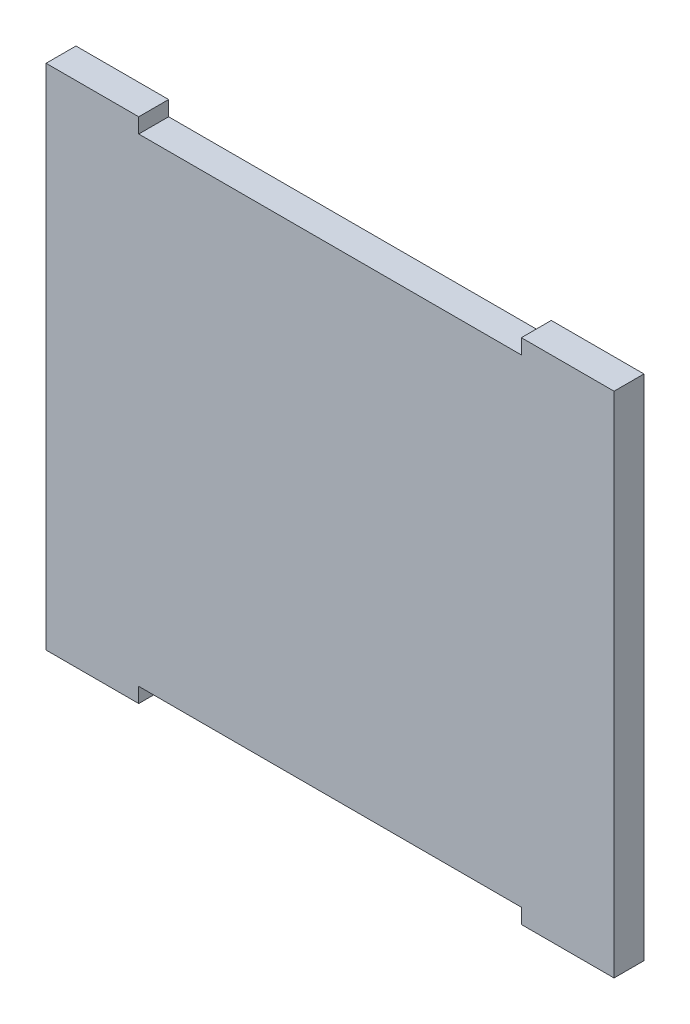
ISO-10303-21;
HEADER;
FILE_DESCRIPTION(('STEP AP214'),'2;1');
FILE_NAME('part.step','',(''),(''),'','','');
FILE_SCHEMA(('AUTOMOTIVE_DESIGN { 1 0 10303 214 1 1 1 1 }'));
ENDSEC;
DATA;
#1=APPLICATION_CONTEXT('core data for automotive mechanical design processes');
#2=APPLICATION_PROTOCOL_DEFINITION('international standard','automotive_design',2000,#1);
#3=PRODUCT_CONTEXT('',#1,'mechanical');
#4=PRODUCT('Part','Part','',(#3));
#5=PRODUCT_RELATED_PRODUCT_CATEGORY('part','',(#4));
#6=PRODUCT_DEFINITION_FORMATION('','',#4);
#7=PRODUCT_DEFINITION_CONTEXT('part definition',#1,'design');
#8=PRODUCT_DEFINITION('design','',#6,#7);
#9=PRODUCT_DEFINITION_SHAPE('','',#8);
#10=(LENGTH_UNIT() NAMED_UNIT(*) SI_UNIT(.MILLI.,.METRE.));
#11=(NAMED_UNIT(*) PLANE_ANGLE_UNIT() SI_UNIT($,.RADIAN.));
#12=(NAMED_UNIT(*) SI_UNIT($,.STERADIAN.) SOLID_ANGLE_UNIT());
#13=UNCERTAINTY_MEASURE_WITH_UNIT(LENGTH_MEASURE(1.E-05),#10,'distance_accuracy_value','');
#14=(GEOMETRIC_REPRESENTATION_CONTEXT(3) GLOBAL_UNCERTAINTY_ASSIGNED_CONTEXT((#13)) GLOBAL_UNIT_ASSIGNED_CONTEXT((#10,
#11,#12)) REPRESENTATION_CONTEXT('',''));
#15=CARTESIAN_POINT('',(0.,0.,0.));
#16=DIRECTION('',(0.,0.,1.));
#17=DIRECTION('',(1.,0.,0.));
#18=AXIS2_PLACEMENT_3D('',#15,#16,#17);
#19=CARTESIAN_POINT('',(0.,373.563048005149,10.));
#20=DIRECTION('',(0.,-1.,0.));
#21=DIRECTION('',(0.,0.,-1.));
#22=AXIS2_PLACEMENT_3D('',#19,#20,#21);
#23=PLANE('',#22);
#24=DIRECTION('',(-1.,0.,0.));
#25=VECTOR('',#24,1.);
#26=CARTESIAN_POINT('',(0.,373.563048005149,0.));
#27=LINE('',#26,#25);
#28=CARTESIAN_POINT('',(1270.86408160644,373.563048005149,0.));
#29=VERTEX_POINT('',#28);
#30=CARTESIAN_POINT('',(1239.86408160644,373.563048005149,0.));
#31=VERTEX_POINT('',#30);
#32=EDGE_CURVE('E152',#29,#31,#27,.T.);
#33=ORIENTED_EDGE('',*,*,#32,.F.);
#34=DIRECTION('',(0.,0.,-1.));
#35=VECTOR('',#34,1.);
#36=CARTESIAN_POINT('',(1270.86408160644,373.563048005149,10.));
#37=LINE('',#36,#35);
#38=CARTESIAN_POINT('',(1270.86408160644,373.563048005149,10.));
#39=VERTEX_POINT('',#38);
#40=EDGE_CURVE('E11',#39,#29,#37,.T.);
#41=ORIENTED_EDGE('',*,*,#40,.F.);
#42=DIRECTION('',(-1.,0.,0.));
#43=VECTOR('',#42,1.);
#44=CARTESIAN_POINT('',(0.,373.563048005149,10.));
#45=LINE('',#44,#43);
#46=CARTESIAN_POINT('',(1239.86408160644,373.563048005149,10.));
#47=VERTEX_POINT('',#46);
#48=EDGE_CURVE('E183',#39,#47,#45,.T.);
#49=ORIENTED_EDGE('',*,*,#48,.T.);
#50=DIRECTION('',(0.,0.,-1.));
#51=VECTOR('',#50,1.);
#52=CARTESIAN_POINT('',(1239.86408160644,373.563048005149,10.));
#53=LINE('',#52,#51);
#54=EDGE_CURVE('E51',#47,#31,#53,.T.);
#55=ORIENTED_EDGE('',*,*,#54,.T.);
#56=EDGE_LOOP('',(#33,#41,#49,#55));
#57=FACE_BOUND('',#56,.T.);
#58=ADVANCED_FACE('F35',(#57),#23,.T.);
#59=CARTESIAN_POINT('',(1270.86408160644,0.,10.));
#60=DIRECTION('',(1.,0.,0.));
#61=DIRECTION('',(0.,0.,-1.));
#62=AXIS2_PLACEMENT_3D('',#59,#60,#61);
#63=PLANE('',#62);
#64=DIRECTION('',(0.,-1.,0.));
#65=VECTOR('',#64,1.);
#66=CARTESIAN_POINT('',(1270.86408160644,0.,0.));
#67=LINE('',#66,#65);
#68=CARTESIAN_POINT('',(1270.86408160644,378.563048005149,0.));
#69=VERTEX_POINT('',#68);
#70=EDGE_CURVE('E154',#69,#29,#67,.T.);
#71=ORIENTED_EDGE('',*,*,#70,.F.);
#72=DIRECTION('',(0.,0.,-1.));
#73=VECTOR('',#72,1.);
#74=CARTESIAN_POINT('',(1270.86408160644,378.563048005149,10.));
#75=LINE('',#74,#73);
#76=CARTESIAN_POINT('',(1270.86408160644,378.563048005149,10.));
#77=VERTEX_POINT('',#76);
#78=EDGE_CURVE('E43',#77,#69,#75,.T.);
#79=ORIENTED_EDGE('',*,*,#78,.F.);
#80=DIRECTION('',(0.,-1.,0.));
#81=VECTOR('',#80,1.);
#82=CARTESIAN_POINT('',(1270.86408160644,0.,10.));
#83=LINE('',#82,#81);
#84=EDGE_CURVE('E365',#77,#39,#83,.T.);
#85=ORIENTED_EDGE('',*,*,#84,.T.);
#86=ORIENTED_EDGE('',*,*,#40,.T.);
#87=EDGE_LOOP('',(#71,#79,#85,#86));
#88=FACE_BOUND('',#87,.T.);
#89=ADVANCED_FACE('F209',(#88),#63,.T.);
#90=CARTESIAN_POINT('',(0.,378.563048005149,10.));
#91=DIRECTION('',(0.,-1.,0.));
#92=DIRECTION('',(0.,0.,-1.));
#93=AXIS2_PLACEMENT_3D('',#90,#91,#92);
#94=PLANE('',#93);
#95=DIRECTION('',(-1.,0.,0.));
#96=VECTOR('',#95,1.);
#97=CARTESIAN_POINT('',(0.,378.563048005149,0.));
#98=LINE('',#97,#96);
#99=CARTESIAN_POINT('',(1398.86408160644,378.563048005149,0.));
#100=VERTEX_POINT('',#99);
#101=EDGE_CURVE('E157',#100,#69,#98,.T.);
#102=ORIENTED_EDGE('',*,*,#101,.F.);
#103=DIRECTION('',(0.,0.,-1.));
#104=VECTOR('',#103,1.);
#105=CARTESIAN_POINT('',(1398.86408160644,378.563048005149,10.));
#106=LINE('',#105,#104);
#107=CARTESIAN_POINT('',(1398.86408160644,378.563048005149,10.));
#108=VERTEX_POINT('',#107);
#109=EDGE_CURVE('E198',#108,#100,#106,.T.);
#110=ORIENTED_EDGE('',*,*,#109,.F.);
#111=DIRECTION('',(-1.,0.,0.));
#112=VECTOR('',#111,1.);
#113=CARTESIAN_POINT('',(0.,378.563048005149,10.));
#114=LINE('',#113,#112);
#115=EDGE_CURVE('E205',#108,#77,#114,.T.);
#116=ORIENTED_EDGE('',*,*,#115,.T.);
#117=ORIENTED_EDGE('',*,*,#78,.T.);
#118=EDGE_LOOP('',(#102,#110,#116,#117));
#119=FACE_BOUND('',#118,.T.);
#120=ADVANCED_FACE('F203',(#119),#94,.T.);
#121=CARTESIAN_POINT('',(1398.86408160644,0.,10.));
#122=DIRECTION('',(1.,0.,0.));
#123=DIRECTION('',(0.,0.,-1.));
#124=AXIS2_PLACEMENT_3D('',#121,#122,#123);
#125=PLANE('',#124);
#126=DIRECTION('',(0.,-1.,0.));
#127=VECTOR('',#126,1.);
#128=CARTESIAN_POINT('',(1398.86408160644,0.,0.));
#129=LINE('',#128,#127);
#130=CARTESIAN_POINT('',(1398.86408160644,373.563048005149,0.));
#131=VERTEX_POINT('',#130);
#132=EDGE_CURVE('E160',#100,#131,#129,.T.);
#133=ORIENTED_EDGE('',*,*,#132,.T.);
#134=DIRECTION('',(0.,0.,-1.));
#135=VECTOR('',#134,1.);
#136=CARTESIAN_POINT('',(1398.86408160644,373.563048005149,10.));
#137=LINE('',#136,#135);
#138=CARTESIAN_POINT('',(1398.86408160644,373.563048005149,10.));
#139=VERTEX_POINT('',#138);
#140=EDGE_CURVE('E195',#139,#131,#137,.T.);
#141=ORIENTED_EDGE('',*,*,#140,.F.);
#142=DIRECTION('',(0.,-1.,0.));
#143=VECTOR('',#142,1.);
#144=CARTESIAN_POINT('',(1398.86408160644,0.,10.));
#145=LINE('',#144,#143);
#146=EDGE_CURVE('E226',#108,#139,#145,.T.);
#147=ORIENTED_EDGE('',*,*,#146,.F.);
#148=ORIENTED_EDGE('',*,*,#109,.T.);
#149=EDGE_LOOP('',(#133,#141,#147,#148));
#150=FACE_BOUND('',#149,.T.);
#151=ADVANCED_FACE('F216',(#150),#125,.F.);
#152=CARTESIAN_POINT('',(0.,373.563048005149,10.));
#153=DIRECTION('',(0.,1.,0.));
#154=DIRECTION('',(0.,0.,1.));
#155=AXIS2_PLACEMENT_3D('',#152,#153,#154);
#156=PLANE('',#155);
#157=DIRECTION('',(1.,0.,0.));
#158=VECTOR('',#157,1.);
#159=CARTESIAN_POINT('',(0.,373.563048005149,0.));
#160=LINE('',#159,#158);
#161=CARTESIAN_POINT('',(1429.86408160644,373.563048005149,0.));
#162=VERTEX_POINT('',#161);
#163=EDGE_CURVE('E162',#131,#162,#160,.T.);
#164=ORIENTED_EDGE('',*,*,#163,.T.);
#165=DIRECTION('',(0.,0.,-1.));
#166=VECTOR('',#165,1.);
#167=CARTESIAN_POINT('',(1429.86408160644,373.563048005149,10.));
#168=LINE('',#167,#166);
#169=CARTESIAN_POINT('',(1429.86408160644,373.563048005149,10.));
#170=VERTEX_POINT('',#169);
#171=EDGE_CURVE('E193',#170,#162,#168,.T.);
#172=ORIENTED_EDGE('',*,*,#171,.F.);
#173=DIRECTION('',(1.,0.,0.));
#174=VECTOR('',#173,1.);
#175=CARTESIAN_POINT('',(0.,373.563048005149,10.));
#176=LINE('',#175,#174);
#177=EDGE_CURVE('E222',#139,#170,#176,.T.);
#178=ORIENTED_EDGE('',*,*,#177,.F.);
#179=ORIENTED_EDGE('',*,*,#140,.T.);
#180=EDGE_LOOP('',(#164,#172,#178,#179));
#181=FACE_BOUND('',#180,.T.);
#182=ADVANCED_FACE('F220',(#181),#156,.F.);
#183=CARTESIAN_POINT('',(1429.86408160644,0.,10.));
#184=DIRECTION('',(1.,0.,0.));
#185=DIRECTION('',(0.,0.,-1.));
#186=AXIS2_PLACEMENT_3D('',#183,#184,#185);
#187=PLANE('',#186);
#188=DIRECTION('',(0.,-1.,0.));
#189=VECTOR('',#188,1.);
#190=CARTESIAN_POINT('',(1429.86408160644,0.,0.));
#191=LINE('',#190,#189);
#192=CARTESIAN_POINT('',(1429.86408160644,543.563048005149,0.));
#193=VERTEX_POINT('',#192);
#194=EDGE_CURVE('E165',#193,#162,#191,.T.);
#195=ORIENTED_EDGE('',*,*,#194,.F.);
#196=DIRECTION('',(0.,0.,-1.));
#197=VECTOR('',#196,1.);
#198=CARTESIAN_POINT('',(1429.86408160644,543.563048005149,10.));
#199=LINE('',#198,#197);
#200=CARTESIAN_POINT('',(1429.86408160644,543.563048005149,10.));
#201=VERTEX_POINT('',#200);
#202=EDGE_CURVE('E191',#201,#193,#199,.T.);
#203=ORIENTED_EDGE('',*,*,#202,.F.);
#204=DIRECTION('',(0.,-1.,0.));
#205=VECTOR('',#204,1.);
#206=CARTESIAN_POINT('',(1429.86408160644,0.,10.));
#207=LINE('',#206,#205);
#208=EDGE_CURVE('E225',#201,#170,#207,.T.);
#209=ORIENTED_EDGE('',*,*,#208,.T.);
#210=ORIENTED_EDGE('',*,*,#171,.T.);
#211=EDGE_LOOP('',(#195,#203,#209,#210));
#212=FACE_BOUND('',#211,.T.);
#213=ADVANCED_FACE('F264',(#212),#187,.T.);
#214=CARTESIAN_POINT('',(0.,543.563048005149,10.));
#215=DIRECTION('',(0.,1.,0.));
#216=DIRECTION('',(0.,0.,1.));
#217=AXIS2_PLACEMENT_3D('',#214,#215,#216);
#218=PLANE('',#217);
#219=DIRECTION('',(1.,0.,0.));
#220=VECTOR('',#219,1.);
#221=CARTESIAN_POINT('',(0.,543.563048005149,0.));
#222=LINE('',#221,#220);
#223=CARTESIAN_POINT('',(1398.86408160644,543.563048005149,0.));
#224=VERTEX_POINT('',#223);
#225=EDGE_CURVE('E168',#224,#193,#222,.T.);
#226=ORIENTED_EDGE('',*,*,#225,.F.);
#227=DIRECTION('',(0.,0.,-1.));
#228=VECTOR('',#227,1.);
#229=CARTESIAN_POINT('',(1398.86408160644,543.563048005149,10.));
#230=LINE('',#229,#228);
#231=CARTESIAN_POINT('',(1398.86408160644,543.563048005149,10.));
#232=VERTEX_POINT('',#231);
#233=EDGE_CURVE('E189',#232,#224,#230,.T.);
#234=ORIENTED_EDGE('',*,*,#233,.F.);
#235=DIRECTION('',(1.,0.,0.));
#236=VECTOR('',#235,1.);
#237=CARTESIAN_POINT('',(0.,543.563048005149,10.));
#238=LINE('',#237,#236);
#239=EDGE_CURVE('E228',#232,#201,#238,.T.);
#240=ORIENTED_EDGE('',*,*,#239,.T.);
#241=ORIENTED_EDGE('',*,*,#202,.T.);
#242=EDGE_LOOP('',(#226,#234,#240,#241));
#243=FACE_BOUND('',#242,.T.);
#244=ADVANCED_FACE('F267',(#243),#218,.T.);
#245=CARTESIAN_POINT('',(1398.86408160644,0.,10.));
#246=DIRECTION('',(-1.,0.,0.));
#247=DIRECTION('',(0.,0.,1.));
#248=AXIS2_PLACEMENT_3D('',#245,#246,#247);
#249=PLANE('',#248);
#250=DIRECTION('',(0.,1.,0.));
#251=VECTOR('',#250,1.);
#252=CARTESIAN_POINT('',(1398.86408160644,0.,0.));
#253=LINE('',#252,#251);
#254=CARTESIAN_POINT('',(1398.86408160644,538.563048005149,0.));
#255=VERTEX_POINT('',#254);
#256=EDGE_CURVE('E171',#255,#224,#253,.T.);
#257=ORIENTED_EDGE('',*,*,#256,.F.);
#258=DIRECTION('',(0.,0.,-1.));
#259=VECTOR('',#258,1.);
#260=CARTESIAN_POINT('',(1398.86408160644,538.563048005149,10.));
#261=LINE('',#260,#259);
#262=CARTESIAN_POINT('',(1398.86408160644,538.563048005149,10.));
#263=VERTEX_POINT('',#262);
#264=EDGE_CURVE('E187',#263,#255,#261,.T.);
#265=ORIENTED_EDGE('',*,*,#264,.F.);
#266=DIRECTION('',(0.,1.,0.));
#267=VECTOR('',#266,1.);
#268=CARTESIAN_POINT('',(1398.86408160644,0.,10.));
#269=LINE('',#268,#267);
#270=EDGE_CURVE('E235',#263,#232,#269,.T.);
#271=ORIENTED_EDGE('',*,*,#270,.T.);
#272=ORIENTED_EDGE('',*,*,#233,.T.);
#273=EDGE_LOOP('',(#257,#265,#271,#272));
#274=FACE_BOUND('',#273,.T.);
#275=ADVANCED_FACE('F271',(#274),#249,.T.);
#276=CARTESIAN_POINT('',(0.,538.563048005149,10.));
#277=DIRECTION('',(0.,1.,0.));
#278=DIRECTION('',(0.,0.,1.));
#279=AXIS2_PLACEMENT_3D('',#276,#277,#278);
#280=PLANE('',#279);
#281=DIRECTION('',(1.,0.,0.));
#282=VECTOR('',#281,1.);
#283=CARTESIAN_POINT('',(0.,538.563048005149,0.));
#284=LINE('',#283,#282);
#285=CARTESIAN_POINT('',(1270.86408160644,538.563048005149,0.));
#286=VERTEX_POINT('',#285);
#287=EDGE_CURVE('E174',#286,#255,#284,.T.);
#288=ORIENTED_EDGE('',*,*,#287,.F.);
#289=DIRECTION('',(0.,0.,-1.));
#290=VECTOR('',#289,1.);
#291=CARTESIAN_POINT('',(1270.86408160644,538.563048005149,10.));
#292=LINE('',#291,#290);
#293=CARTESIAN_POINT('',(1270.86408160644,538.563048005149,10.));
#294=VERTEX_POINT('',#293);
#295=EDGE_CURVE('E144',#294,#286,#292,.T.);
#296=ORIENTED_EDGE('',*,*,#295,.F.);
#297=DIRECTION('',(1.,0.,0.));
#298=VECTOR('',#297,1.);
#299=CARTESIAN_POINT('',(0.,538.563048005149,10.));
#300=LINE('',#299,#298);
#301=EDGE_CURVE('E134',#294,#263,#300,.T.);
#302=ORIENTED_EDGE('',*,*,#301,.T.);
#303=ORIENTED_EDGE('',*,*,#264,.T.);
#304=EDGE_LOOP('',(#288,#296,#302,#303));
#305=FACE_BOUND('',#304,.T.);
#306=ADVANCED_FACE('F239',(#305),#280,.T.);
#307=CARTESIAN_POINT('',(1270.86408160644,0.,10.));
#308=DIRECTION('',(-1.,0.,0.));
#309=DIRECTION('',(0.,0.,1.));
#310=AXIS2_PLACEMENT_3D('',#307,#308,#309);
#311=PLANE('',#310);
#312=DIRECTION('',(0.,1.,0.));
#313=VECTOR('',#312,1.);
#314=CARTESIAN_POINT('',(1270.86408160644,0.,0.));
#315=LINE('',#314,#313);
#316=CARTESIAN_POINT('',(1270.86408160644,543.563048005149,0.));
#317=VERTEX_POINT('',#316);
#318=EDGE_CURVE('E141',#286,#317,#315,.T.);
#319=ORIENTED_EDGE('',*,*,#318,.T.);
#320=DIRECTION('',(0.,0.,-1.));
#321=VECTOR('',#320,1.);
#322=CARTESIAN_POINT('',(1270.86408160644,543.563048005149,10.));
#323=LINE('',#322,#321);
#324=CARTESIAN_POINT('',(1270.86408160644,543.563048005149,10.));
#325=VERTEX_POINT('',#324);
#326=EDGE_CURVE('E138',#325,#317,#323,.T.);
#327=ORIENTED_EDGE('',*,*,#326,.F.);
#328=DIRECTION('',(0.,1.,0.));
#329=VECTOR('',#328,1.);
#330=CARTESIAN_POINT('',(1270.86408160644,0.,10.));
#331=LINE('',#330,#329);
#332=EDGE_CURVE('E126',#294,#325,#331,.T.);
#333=ORIENTED_EDGE('',*,*,#332,.F.);
#334=ORIENTED_EDGE('',*,*,#295,.T.);
#335=EDGE_LOOP('',(#319,#327,#333,#334));
#336=FACE_BOUND('',#335,.T.);
#337=ADVANCED_FACE('F139',(#336),#311,.F.);
#338=CARTESIAN_POINT('',(0.,543.563048005149,10.));
#339=DIRECTION('',(0.,-1.,0.));
#340=DIRECTION('',(0.,0.,-1.));
#341=AXIS2_PLACEMENT_3D('',#338,#339,#340);
#342=PLANE('',#341);
#343=DIRECTION('',(-1.,0.,0.));
#344=VECTOR('',#343,1.);
#345=CARTESIAN_POINT('',(0.,543.563048005149,0.));
#346=LINE('',#345,#344);
#347=CARTESIAN_POINT('',(1239.86408160644,543.563048005149,0.));
#348=VERTEX_POINT('',#347);
#349=EDGE_CURVE('E178',#317,#348,#346,.T.);
#350=ORIENTED_EDGE('',*,*,#349,.T.);
#351=DIRECTION('',(0.,0.,-1.));
#352=VECTOR('',#351,1.);
#353=CARTESIAN_POINT('',(1239.86408160644,543.563048005149,10.));
#354=LINE('',#353,#352);
#355=CARTESIAN_POINT('',(1239.86408160644,543.563048005149,10.));
#356=VERTEX_POINT('',#355);
#357=EDGE_CURVE('E89',#356,#348,#354,.T.);
#358=ORIENTED_EDGE('',*,*,#357,.F.);
#359=DIRECTION('',(-1.,0.,0.));
#360=VECTOR('',#359,1.);
#361=CARTESIAN_POINT('',(0.,543.563048005149,10.));
#362=LINE('',#361,#360);
#363=EDGE_CURVE('E131',#325,#356,#362,.T.);
#364=ORIENTED_EDGE('',*,*,#363,.F.);
#365=ORIENTED_EDGE('',*,*,#326,.T.);
#366=EDGE_LOOP('',(#350,#358,#364,#365));
#367=FACE_BOUND('',#366,.T.);
#368=ADVANCED_FACE('F146',(#367),#342,.F.);
#369=CARTESIAN_POINT('',(1239.86408160644,0.,10.));
#370=DIRECTION('',(-1.,0.,0.));
#371=DIRECTION('',(0.,0.,1.));
#372=AXIS2_PLACEMENT_3D('',#369,#370,#371);
#373=PLANE('',#372);
#374=DIRECTION('',(0.,1.,0.));
#375=VECTOR('',#374,1.);
#376=CARTESIAN_POINT('',(1239.86408160644,0.,0.));
#377=LINE('',#376,#375);
#378=EDGE_CURVE('E180',#31,#348,#377,.T.);
#379=ORIENTED_EDGE('',*,*,#378,.F.);
#380=ORIENTED_EDGE('',*,*,#54,.F.);
#381=DIRECTION('',(0.,1.,0.));
#382=VECTOR('',#381,1.);
#383=CARTESIAN_POINT('',(1239.86408160644,0.,10.));
#384=LINE('',#383,#382);
#385=EDGE_CURVE('E147',#47,#356,#384,.T.);
#386=ORIENTED_EDGE('',*,*,#385,.T.);
#387=ORIENTED_EDGE('',*,*,#357,.T.);
#388=EDGE_LOOP('',(#379,#380,#386,#387));
#389=FACE_BOUND('',#388,.T.);
#390=ADVANCED_FACE('F241',(#389),#373,.T.);
#391=CARTESIAN_POINT('',(0.,0.,10.));
#392=DIRECTION('',(0.,0.,1.));
#393=DIRECTION('',(1.,0.,0.));
#394=AXIS2_PLACEMENT_3D('',#391,#392,#393);
#395=PLANE('',#394);
#396=ORIENTED_EDGE('',*,*,#48,.F.);
#397=ORIENTED_EDGE('',*,*,#84,.F.);
#398=ORIENTED_EDGE('',*,*,#115,.F.);
#399=ORIENTED_EDGE('',*,*,#146,.T.);
#400=ORIENTED_EDGE('',*,*,#177,.T.);
#401=ORIENTED_EDGE('',*,*,#208,.F.);
#402=ORIENTED_EDGE('',*,*,#239,.F.);
#403=ORIENTED_EDGE('',*,*,#270,.F.);
#404=ORIENTED_EDGE('',*,*,#301,.F.);
#405=ORIENTED_EDGE('',*,*,#332,.T.);
#406=ORIENTED_EDGE('',*,*,#363,.T.);
#407=ORIENTED_EDGE('',*,*,#385,.F.);
#408=EDGE_LOOP('',(#396,#397,#398,#399,#400,#401,#402,#403,#404,#405,#406,#407));
#409=FACE_BOUND('',#408,.T.);
#410=ADVANCED_FACE('F128',(#409),#395,.T.);
#411=CARTESIAN_POINT('',(0.,0.,0.));
#412=DIRECTION('',(0.,0.,1.));
#413=DIRECTION('',(1.,0.,0.));
#414=AXIS2_PLACEMENT_3D('',#411,#412,#413);
#415=PLANE('',#414);
#416=ORIENTED_EDGE('',*,*,#32,.T.);
#417=ORIENTED_EDGE('',*,*,#378,.T.);
#418=ORIENTED_EDGE('',*,*,#349,.F.);
#419=ORIENTED_EDGE('',*,*,#318,.F.);
#420=ORIENTED_EDGE('',*,*,#287,.T.);
#421=ORIENTED_EDGE('',*,*,#256,.T.);
#422=ORIENTED_EDGE('',*,*,#225,.T.);
#423=ORIENTED_EDGE('',*,*,#194,.T.);
#424=ORIENTED_EDGE('',*,*,#163,.F.);
#425=ORIENTED_EDGE('',*,*,#132,.F.);
#426=ORIENTED_EDGE('',*,*,#101,.T.);
#427=ORIENTED_EDGE('',*,*,#70,.T.);
#428=EDGE_LOOP('',(#416,#417,#418,#419,#420,#421,#422,#423,#424,#425,#426,#427));
#429=FACE_BOUND('',#428,.T.);
#430=ADVANCED_FACE('F212',(#429),#415,.F.);
#431=CLOSED_SHELL('',(#58,#89,#120,#151,#182,#213,#244,#275,#306,#337,#368,#390,#410,#430));
#432=MANIFOLD_SOLID_BREP('B2',#431);
#433=ADVANCED_BREP_SHAPE_REPRESENTATION('',(#18,#432),#14);
#434=SHAPE_DEFINITION_REPRESENTATION(#9,#433);
ENDSEC;
END-ISO-10303-21;
